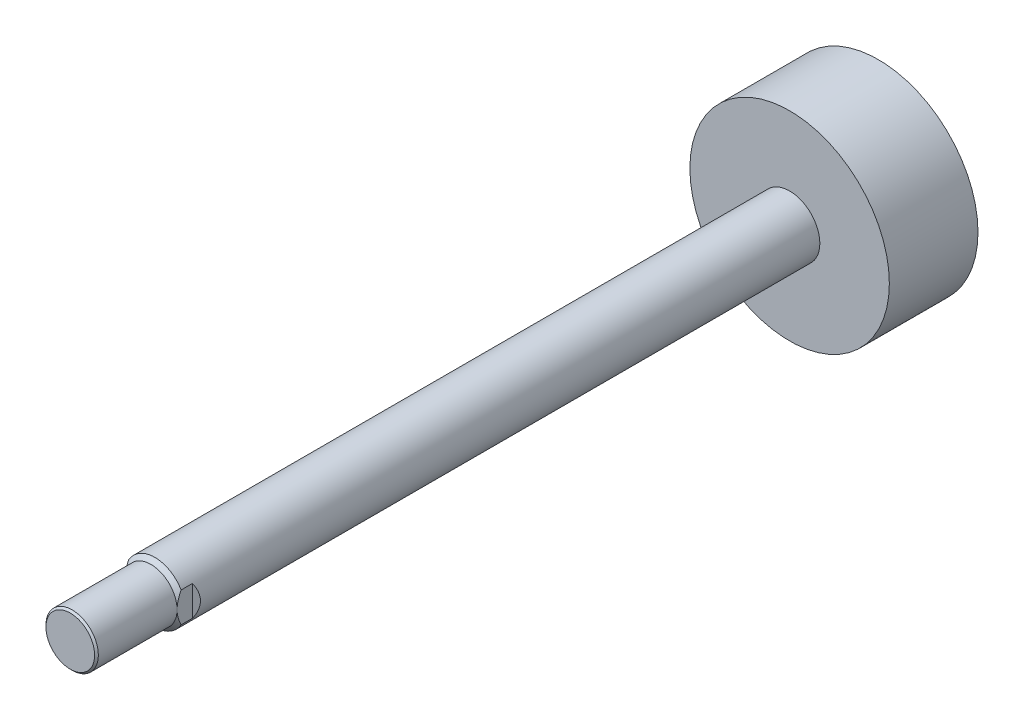
ISO-10303-21;
HEADER;
FILE_DESCRIPTION(('STEP AP214'),'2;1');
FILE_NAME('part.step','',(''),(''),'','','');
FILE_SCHEMA(('AUTOMOTIVE_DESIGN { 1 0 10303 214 1 1 1 1 }'));
ENDSEC;
DATA;
#1=APPLICATION_CONTEXT('core data for automotive mechanical design processes');
#2=APPLICATION_PROTOCOL_DEFINITION('international standard','automotive_design',2000,#1);
#3=PRODUCT_CONTEXT('',#1,'mechanical');
#4=PRODUCT('Part','Part','',(#3));
#5=PRODUCT_RELATED_PRODUCT_CATEGORY('part','',(#4));
#6=PRODUCT_DEFINITION_FORMATION('','',#4);
#7=PRODUCT_DEFINITION_CONTEXT('part definition',#1,'design');
#8=PRODUCT_DEFINITION('design','',#6,#7);
#9=PRODUCT_DEFINITION_SHAPE('','',#8);
#10=(LENGTH_UNIT() NAMED_UNIT(*) SI_UNIT(.MILLI.,.METRE.));
#11=(NAMED_UNIT(*) PLANE_ANGLE_UNIT() SI_UNIT($,.RADIAN.));
#12=(NAMED_UNIT(*) SI_UNIT($,.STERADIAN.) SOLID_ANGLE_UNIT());
#13=UNCERTAINTY_MEASURE_WITH_UNIT(LENGTH_MEASURE(1.E-05),#10,'distance_accuracy_value','');
#14=(GEOMETRIC_REPRESENTATION_CONTEXT(3) GLOBAL_UNCERTAINTY_ASSIGNED_CONTEXT((#13)) GLOBAL_UNIT_ASSIGNED_CONTEXT((#10,
#11,#12)) REPRESENTATION_CONTEXT('',''));
#15=CARTESIAN_POINT('',(0.,0.,0.));
#16=DIRECTION('',(0.,0.,1.));
#17=DIRECTION('',(1.,0.,0.));
#18=AXIS2_PLACEMENT_3D('',#15,#16,#17);
#19=CARTESIAN_POINT('',(0.,0.,10.0000000000001));
#20=DIRECTION('',(0.,0.,-1.));
#21=DIRECTION('',(-1.,0.,0.));
#22=AXIS2_PLACEMENT_3D('',#19,#20,#21);
#23=CONICAL_SURFACE('',#22,15.,0.785398163397461);
#24=CARTESIAN_POINT('',(0.,0.,10.0000000000001));
#25=DIRECTION('',(0.,0.,1.));
#26=DIRECTION('',(1.,0.,0.));
#27=AXIS2_PLACEMENT_3D('',#24,#25,#26);
#28=CIRCLE('',#27,15.);
#29=CARTESIAN_POINT('',(13.,7.48331477354788,10.0000000000001));
#30=VERTEX_POINT('',#29);
#31=CARTESIAN_POINT('',(-13.,7.48331477354788,10.0000000000001));
#32=VERTEX_POINT('',#31);
#33=EDGE_CURVE('E120',#30,#32,#28,.T.);
#34=ORIENTED_EDGE('',*,*,#33,.T.);
#35=CARTESIAN_POINT('',(-13.,-36.44095784037,-13.6903529103002));
#36=CARTESIAN_POINT('',(-13.,-36.0162735049657,-13.2903617459706));
#37=CARTESIAN_POINT('',(-13.,-35.5911981977071,-12.8907858042931));
#38=CARTESIAN_POINT('',(-13.,-34.7401767103147,-12.0925609898602));
#39=CARTESIAN_POINT('',(-13.,-34.3142305286753,-11.69391211871));
#40=CARTESIAN_POINT('',(-13.,-33.0349118853332,-10.4994633484616));
#41=CARTESIAN_POINT('',(-13.,-32.1801017326179,-9.70520127025763));
#42=CARTESIAN_POINT('',(-13.,-30.4634632390766,-8.11969262225469));
#43=CARTESIAN_POINT('',(-13.,-29.6016222700359,-7.32845971744985));
#44=CARTESIAN_POINT('',(-13.,-27.871988564408,-5.75256708411677));
#45=CARTESIAN_POINT('',(-13.,-27.0041960110263,-4.9679071548921));
#46=CARTESIAN_POINT('',(-13.,-25.6510487249394,-3.7563998424639));
#47=CARTESIAN_POINT('',(-13.,-25.1683536384719,-3.32658160243338));
#48=CARTESIAN_POINT('',(-13.,-24.2002542905434,-2.47000833681891));
#49=CARTESIAN_POINT('',(-13.,-23.7148500395842,-2.04325329937554));
#50=CARTESIAN_POINT('',(-13.,-22.7408373069011,-1.19330262631773));
#51=CARTESIAN_POINT('',(-13.,-22.2522284734712,-0.770107393435782));
#52=CARTESIAN_POINT('',(-13.,-21.2713218987959,0.0719867477251748));
#53=CARTESIAN_POINT('',(-13.,-20.7790241715431,0.490885672286422));
#54=CARTESIAN_POINT('',(-13.,-19.7907814474105,1.32292203273235));
#55=CARTESIAN_POINT('',(-13.,-19.2948426764584,1.73606685421813));
#56=CARTESIAN_POINT('',(-13.,-18.2977930237187,2.55609728710099));
#57=CARTESIAN_POINT('',(-13.,-17.7966820474835,2.96298278386));
#58=CARTESIAN_POINT('',(-13.,-16.7883692515955,3.7689484659766));
#59=CARTESIAN_POINT('',(-13.,-16.2811686272203,4.16803014391636));
#60=CARTESIAN_POINT('',(-13.,-15.2593190868725,4.95652043660869));
#61=CARTESIAN_POINT('',(-13.,-14.7446705618227,5.34592955615767));
#62=CARTESIAN_POINT('',(-13.,-13.823144224884,6.02618208273716));
#63=CARTESIAN_POINT('',(-13.,-13.4180826907806,6.31948237038202));
#64=CARTESIAN_POINT('',(-13.,-12.6015554708222,6.89707610970917));
#65=CARTESIAN_POINT('',(-13.,-12.1900896351103,7.18136935015779));
#66=CARTESIAN_POINT('',(-13.,-11.3589954832515,7.73930041941608));
#67=CARTESIAN_POINT('',(-13.,-10.9393550223908,8.01292023807748));
#68=CARTESIAN_POINT('',(-13.,-10.0913222356071,8.54624565264295));
#69=CARTESIAN_POINT('',(-13.,-9.6629302449581,8.80595178020953));
#70=CARTESIAN_POINT('',(-13.,-8.8048971566943,9.30266078868258));
#71=CARTESIAN_POINT('',(-13.,-8.37546717118582,9.54002340749155));
#72=CARTESIAN_POINT('',(-13.,-7.50558132305574,9.99347529724473));
#73=CARTESIAN_POINT('',(-13.,-7.06512318330145,10.2095601284743));
#74=CARTESIAN_POINT('',(-13.,-5.72751982890662,10.8163865420762));
#75=CARTESIAN_POINT('',(-13.,-4.81082452642711,11.1677192243014));
#76=CARTESIAN_POINT('',(-13.,-3.54783395938275,11.5281243825654));
#77=CARTESIAN_POINT('',(-13.,-3.22208570315507,11.6104829179193));
#78=CARTESIAN_POINT('',(-13.,-2.56567935594451,11.7531092091747));
#79=CARTESIAN_POINT('',(-13.,-2.23502093680882,11.8133754816439));
#80=CARTESIAN_POINT('',(-13.,-1.57121991214288,11.909496290171));
#81=CARTESIAN_POINT('',(-13.,-1.23808858984476,11.9454280542976));
#82=CARTESIAN_POINT('',(-13.,-0.570034221047799,11.9917764682808));
#83=CARTESIAN_POINT('',(-13.,-0.235111120817173,12.0021923486206));
#84=CARTESIAN_POINT('',(-13.,0.493817825444919,11.9965869809205));
#85=CARTESIAN_POINT('',(-13.,0.887793983726784,11.9755628147745));
#86=CARTESIAN_POINT('',(-13.,1.67233959764857,11.8986973127531));
#87=CARTESIAN_POINT('',(-13.,2.06290835869698,11.8428490387806));
#88=CARTESIAN_POINT('',(-13.,2.84259006588821,11.6984304171011));
#89=CARTESIAN_POINT('',(-13.,3.23163270916168,11.6094854451656));
#90=CARTESIAN_POINT('',(-13.,4.00189033711246,11.4030386515983));
#91=CARTESIAN_POINT('',(-13.,4.3831065735218,11.2855414357271));
#92=CARTESIAN_POINT('',(-13.,5.18861304220164,11.0085845293945));
#93=CARTESIAN_POINT('',(-13.,5.61167672584231,10.8455856752197));
#94=CARTESIAN_POINT('',(-13.,6.44715880049027,10.4940669063348));
#95=CARTESIAN_POINT('',(-13.,6.85957224294695,10.3055353733623));
#96=CARTESIAN_POINT('',(-13.,7.67564363978527,9.9073449369549));
#97=CARTESIAN_POINT('',(-13.,8.07926896052577,9.69761967058881));
#98=CARTESIAN_POINT('',(-13.,8.87735620051123,9.26164681937318));
#99=CARTESIAN_POINT('',(-13.,9.2718195067228,9.0354017571001));
#100=CARTESIAN_POINT('',(-13.,10.0363254311204,8.57935029585433));
#101=CARTESIAN_POINT('',(-13.,10.4066975615818,8.3500934055512));
#102=CARTESIAN_POINT('',(-13.,11.1410350821367,7.88150743083431));
#103=CARTESIAN_POINT('',(-13.,11.5049999626677,7.64217755041187));
#104=CARTESIAN_POINT('',(-13.,12.2244119403413,7.15718343885012));
#105=CARTESIAN_POINT('',(-13.,12.5799040114605,6.91158567643806));
#106=CARTESIAN_POINT('',(-13.,13.2859497439946,6.41359475991637));
#107=CARTESIAN_POINT('',(-13.,13.6365047886379,6.16120356926212));
#108=CARTESIAN_POINT('',(-13.,13.9849843056068,5.90602749483326));
#109=B_SPLINE_CURVE_WITH_KNOTS('',3,(#35,#36,#37,#38,#39,#40,#41,#42,#43,#44,#45,#46,#47,#48,
#49,#50,#51,#52,#53,#54,#55,#56,#57,#58,#59,#60,#61,#62,#63,#64,#65,#66,#67,#68,#69,#70,#71,#72,
#73,#74,#75,#76,#77,#78,#79,#80,#81,#82,#83,#84,#85,#86,#87,#88,#89,#90,#91,#92,#93,#94,#95,#96,
#97,#98,#99,#100,#101,#102,#103,#104,#105,#106,#107,#108),.UNSPECIFIED.,.F.,.F.,(4,2,2,2,2,2,2,
2,2,2,2,2,2,2,2,2,2,2,2,2,2,2,2,2,2,2,2,2,2,2,2,2,2,2,2,2,4),(0.,1.75018438087813,
3.50037179002691,7.00092144792071,10.5107940990009,14.0205591876124,15.9595291379894,
17.8984915774479,19.8376705049712,21.7768420806373,23.7132392476197,25.6496718371445,
27.5857303627033,29.5216876350513,31.0218887437009,32.5221250091307,34.0247919530723,
35.5274014368966,36.9987731019092,38.4704511281629,41.4021906902973,42.409585611022,
43.4170481630506,44.4212982552684,45.4255786336294,46.6075241991477,47.78970532202,
48.9856961778529,50.1814942364032,51.5405820852472,52.9002904576502,54.2643967293604,
55.6282951356112,56.934859284797,58.2415268785762,59.5376798991111,60.833462241478),.UNSPECIFIED.);
#110=CARTESIAN_POINT('',(-13.,0.,12.));
#111=VERTEX_POINT('',#110);
#112=EDGE_CURVE('E90',#32,#111,#109,.F.);
#113=ORIENTED_EDGE('',*,*,#112,.T.);
#114=CARTESIAN_POINT('',(0.,0.,12.));
#115=DIRECTION('',(0.,0.,1.));
#116=DIRECTION('',(1.,0.,0.));
#117=AXIS2_PLACEMENT_3D('',#114,#115,#116);
#118=CIRCLE('',#117,13.);
#119=CARTESIAN_POINT('',(13.,0.,12.));
#120=VERTEX_POINT('',#119);
#121=EDGE_CURVE('E116',#120,#111,#118,.T.);
#122=ORIENTED_EDGE('',*,*,#121,.F.);
#123=CARTESIAN_POINT('',(13.,-36.44095784037,-13.6903529103002));
#124=CARTESIAN_POINT('',(13.,-36.0162735049657,-13.2903617459706));
#125=CARTESIAN_POINT('',(13.,-35.5911981977071,-12.8907858042931));
#126=CARTESIAN_POINT('',(13.,-34.7401767103147,-12.0925609898602));
#127=CARTESIAN_POINT('',(13.,-34.3142305286753,-11.69391211871));
#128=CARTESIAN_POINT('',(13.,-33.0349118853332,-10.4994633484616));
#129=CARTESIAN_POINT('',(13.,-32.1801017326179,-9.70520127025763));
#130=CARTESIAN_POINT('',(13.,-30.4634632390766,-8.11969262225469));
#131=CARTESIAN_POINT('',(13.,-29.6016222700359,-7.32845971744985));
#132=CARTESIAN_POINT('',(13.,-27.871988564408,-5.75256708411677));
#133=CARTESIAN_POINT('',(13.,-27.0041960110263,-4.9679071548921));
#134=CARTESIAN_POINT('',(13.,-25.6510487249394,-3.7563998424639));
#135=CARTESIAN_POINT('',(13.,-25.1683536384719,-3.32658160243338));
#136=CARTESIAN_POINT('',(13.,-24.2002542905434,-2.47000833681891));
#137=CARTESIAN_POINT('',(13.,-23.7148500395842,-2.04325329937554));
#138=CARTESIAN_POINT('',(13.,-22.7408373069011,-1.19330262631773));
#139=CARTESIAN_POINT('',(13.,-22.2522284734712,-0.770107393435782));
#140=CARTESIAN_POINT('',(13.,-21.2713218987959,0.0719867477251748));
#141=CARTESIAN_POINT('',(13.,-20.7790241715431,0.490885672286422));
#142=CARTESIAN_POINT('',(13.,-19.7907814474105,1.32292203273235));
#143=CARTESIAN_POINT('',(13.,-19.2948426764584,1.73606685421813));
#144=CARTESIAN_POINT('',(13.,-18.2977930237187,2.55609728710099));
#145=CARTESIAN_POINT('',(13.,-17.7966820474835,2.96298278386));
#146=CARTESIAN_POINT('',(13.,-16.7883692515955,3.7689484659766));
#147=CARTESIAN_POINT('',(13.,-16.2811686272203,4.16803014391636));
#148=CARTESIAN_POINT('',(13.,-15.2593190868725,4.95652043660869));
#149=CARTESIAN_POINT('',(13.,-14.7446705618227,5.34592955615767));
#150=CARTESIAN_POINT('',(13.,-13.823144224884,6.02618208273716));
#151=CARTESIAN_POINT('',(13.,-13.4180826907806,6.31948237038202));
#152=CARTESIAN_POINT('',(13.,-12.6015554708222,6.89707610970917));
#153=CARTESIAN_POINT('',(13.,-12.1900896351103,7.18136935015779));
#154=CARTESIAN_POINT('',(13.,-11.3589954832515,7.73930041941608));
#155=CARTESIAN_POINT('',(13.,-10.9393550223908,8.01292023807748));
#156=CARTESIAN_POINT('',(13.,-10.0913222356071,8.54624565264295));
#157=CARTESIAN_POINT('',(13.,-9.6629302449581,8.80595178020953));
#158=CARTESIAN_POINT('',(13.,-8.8048971566943,9.30266078868258));
#159=CARTESIAN_POINT('',(13.,-8.37546717118582,9.54002340749155));
#160=CARTESIAN_POINT('',(13.,-7.50558132305574,9.99347529724473));
#161=CARTESIAN_POINT('',(13.,-7.06512318330145,10.2095601284743));
#162=CARTESIAN_POINT('',(13.,-5.72751982890662,10.8163865420762));
#163=CARTESIAN_POINT('',(13.,-4.81082452642711,11.1677192243014));
#164=CARTESIAN_POINT('',(13.,-3.54783395938275,11.5281243825654));
#165=CARTESIAN_POINT('',(13.,-3.22208570315507,11.6104829179193));
#166=CARTESIAN_POINT('',(13.,-2.56567935594451,11.7531092091747));
#167=CARTESIAN_POINT('',(13.,-2.23502093680882,11.8133754816439));
#168=CARTESIAN_POINT('',(13.,-1.57121991214288,11.909496290171));
#169=CARTESIAN_POINT('',(13.,-1.23808858984476,11.9454280542976));
#170=CARTESIAN_POINT('',(13.,-0.570034221047799,11.9917764682808));
#171=CARTESIAN_POINT('',(13.,-0.235111120817173,12.0021923486206));
#172=CARTESIAN_POINT('',(13.,0.493817825444919,11.9965869809205));
#173=CARTESIAN_POINT('',(13.,0.887793983726784,11.9755628147745));
#174=CARTESIAN_POINT('',(13.,1.67233959764857,11.8986973127531));
#175=CARTESIAN_POINT('',(13.,2.06290835869698,11.8428490387806));
#176=CARTESIAN_POINT('',(13.,2.84259006588821,11.6984304171011));
#177=CARTESIAN_POINT('',(13.,3.23163270916168,11.6094854451656));
#178=CARTESIAN_POINT('',(13.,4.00189033711246,11.4030386515983));
#179=CARTESIAN_POINT('',(13.,4.3831065735218,11.2855414357271));
#180=CARTESIAN_POINT('',(13.,5.18861304220164,11.0085845293945));
#181=CARTESIAN_POINT('',(13.,5.61167672584231,10.8455856752197));
#182=CARTESIAN_POINT('',(13.,6.44715880049027,10.4940669063348));
#183=CARTESIAN_POINT('',(13.,6.85957224294695,10.3055353733623));
#184=CARTESIAN_POINT('',(13.,7.67564363978527,9.9073449369549));
#185=CARTESIAN_POINT('',(13.,8.07926896052577,9.69761967058881));
#186=CARTESIAN_POINT('',(13.,8.87735620051123,9.26164681937318));
#187=CARTESIAN_POINT('',(13.,9.2718195067228,9.0354017571001));
#188=CARTESIAN_POINT('',(13.,10.0363254311204,8.57935029585433));
#189=CARTESIAN_POINT('',(13.,10.4066975615818,8.3500934055512));
#190=CARTESIAN_POINT('',(13.,11.1410350821367,7.88150743083431));
#191=CARTESIAN_POINT('',(13.,11.5049999626677,7.64217755041187));
#192=CARTESIAN_POINT('',(13.,12.2244119403413,7.15718343885012));
#193=CARTESIAN_POINT('',(13.,12.5799040114605,6.91158567643806));
#194=CARTESIAN_POINT('',(13.,13.2859497439946,6.41359475991637));
#195=CARTESIAN_POINT('',(13.,13.6365047886379,6.16120356926212));
#196=CARTESIAN_POINT('',(13.,13.9849843056068,5.90602749483326));
#197=B_SPLINE_CURVE_WITH_KNOTS('',3,(#123,#124,#125,#126,#127,#128,#129,#130,#131,#132,#133,
#134,#135,#136,#137,#138,#139,#140,#141,#142,#143,#144,#145,#146,#147,#148,#149,#150,#151,#152,
#153,#154,#155,#156,#157,#158,#159,#160,#161,#162,#163,#164,#165,#166,#167,#168,#169,#170,#171,
#172,#173,#174,#175,#176,#177,#178,#179,#180,#181,#182,#183,#184,#185,#186,#187,#188,#189,#190,
#191,#192,#193,#194,#195,#196),.UNSPECIFIED.,.F.,.F.,(4,2,2,2,2,2,2,2,2,2,2,2,2,2,2,2,2,2,2,2,2,
2,2,2,2,2,2,2,2,2,2,2,2,2,2,2,4),(0.,1.75018438087813,3.50037179002691,7.00092144792071,
10.5107940990009,14.0205591876124,15.9595291379894,17.8984915774479,19.8376705049712,
21.7768420806373,23.7132392476197,25.6496718371445,27.5857303627033,29.5216876350513,
31.0218887437009,32.5221250091307,34.0247919530723,35.5274014368966,36.9987731019092,
38.4704511281629,41.4021906902973,42.409585611022,43.4170481630506,44.4212982552684,
45.4255786336294,46.6075241991477,47.78970532202,48.9856961778529,50.1814942364032,
51.5405820852472,52.9002904576502,54.2643967293604,55.6282951356112,56.934859284797,
58.2415268785762,59.5376798991111,60.833462241478),.UNSPECIFIED.);
#198=EDGE_CURVE('E133',#120,#30,#197,.T.);
#199=ORIENTED_EDGE('',*,*,#198,.T.);
#200=EDGE_LOOP('',(#34,#113,#122,#199));
#201=FACE_BOUND('',#200,.T.);
#202=ADVANCED_FACE('F39',(#201),#23,.T.);
#203=CARTESIAN_POINT('',(0.,0.,52.));
#204=DIRECTION('',(0.,0.,-1.));
#205=DIRECTION('',(-1.,0.,0.));
#206=AXIS2_PLACEMENT_3D('',#203,#204,#205);
#207=PLANE('',#206);
#208=CARTESIAN_POINT('',(0.,0.,52.));
#209=DIRECTION('',(0.,0.,1.));
#210=DIRECTION('',(1.,0.,0.));
#211=AXIS2_PLACEMENT_3D('',#208,#209,#210);
#212=CIRCLE('',#211,12.08);
#213=CARTESIAN_POINT('',(12.08,0.,52.));
#214=VERTEX_POINT('',#213);
#215=EDGE_CURVE('E110',#214,#214,#212,.T.);
#216=ORIENTED_EDGE('',*,*,#215,.T.);
#217=EDGE_LOOP('',(#216));
#218=FACE_BOUND('',#217,.T.);
#219=ADVANCED_FACE('F41',(#218),#207,.F.);
#220=CARTESIAN_POINT('',(0.,0.,51.08));
#221=DIRECTION('',(0.,0.,-1.));
#222=DIRECTION('',(-1.,0.,0.));
#223=AXIS2_PLACEMENT_3D('',#220,#221,#222);
#224=CONICAL_SURFACE('',#223,13.,0.785398163397461);
#225=ORIENTED_EDGE('',*,*,#215,.F.);
#226=EDGE_LOOP('',(#225));
#227=FACE_BOUND('',#226,.T.);
#228=CARTESIAN_POINT('',(0.,0.,51.08));
#229=DIRECTION('',(0.,0.,1.));
#230=DIRECTION('',(1.,0.,0.));
#231=AXIS2_PLACEMENT_3D('',#228,#229,#230);
#232=CIRCLE('',#231,13.);
#233=CARTESIAN_POINT('',(13.,0.,51.08));
#234=VERTEX_POINT('',#233);
#235=EDGE_CURVE('E113',#234,#234,#232,.T.);
#236=ORIENTED_EDGE('',*,*,#235,.T.);
#237=EDGE_LOOP('',(#236));
#238=FACE_BOUND('',#237,.T.);
#239=ADVANCED_FACE('F178',(#227,#238),#224,.T.);
#240=CARTESIAN_POINT('',(0.,0.,-349.));
#241=DIRECTION('',(0.,0.,1.));
#242=DIRECTION('',(1.,0.,0.));
#243=AXIS2_PLACEMENT_3D('',#240,#241,#242);
#244=CYLINDRICAL_SURFACE('',#243,13.);
#245=ORIENTED_EDGE('',*,*,#235,.F.);
#246=EDGE_LOOP('',(#245));
#247=FACE_BOUND('',#246,.T.);
#248=ORIENTED_EDGE('',*,*,#121,.T.);
#249=EDGE_CURVE('E119',#111,#120,#118,.T.);
#250=ORIENTED_EDGE('',*,*,#249,.T.);
#251=EDGE_LOOP('',(#248,#250));
#252=FACE_BOUND('',#251,.T.);
#253=ADVANCED_FACE('F171',(#247,#252),#244,.T.);
#254=ORIENTED_EDGE('',*,*,#249,.F.);
#255=CARTESIAN_POINT('',(-13.,-7.48331477354788,10.0000000000001));
#256=VERTEX_POINT('',#255);
#257=EDGE_CURVE('E95',#111,#256,#109,.F.);
#258=ORIENTED_EDGE('',*,*,#257,.T.);
#259=CARTESIAN_POINT('',(13.,-7.48331477354788,10.0000000000001));
#260=VERTEX_POINT('',#259);
#261=EDGE_CURVE('E122',#256,#260,#28,.T.);
#262=ORIENTED_EDGE('',*,*,#261,.T.);
#263=EDGE_CURVE('E132',#260,#120,#197,.T.);
#264=ORIENTED_EDGE('',*,*,#263,.T.);
#265=EDGE_LOOP('',(#254,#258,#262,#264));
#266=FACE_BOUND('',#265,.T.);
#267=ADVANCED_FACE('F142',(#266),#23,.T.);
#268=CARTESIAN_POINT('',(0.,0.,-349.));
#269=DIRECTION('',(0.,0.,1.));
#270=DIRECTION('',(1.,0.,0.));
#271=AXIS2_PLACEMENT_3D('',#268,#269,#270);
#272=CYLINDRICAL_SURFACE('',#271,15.);
#273=DIRECTION('',(0.,0.,1.));
#274=VECTOR('',#273,1.);
#275=CARTESIAN_POINT('',(-13.,-7.48331477354788,-349.));
#276=LINE('',#275,#274);
#277=CARTESIAN_POINT('',(-13.,-7.48331477354788,4.39999999999996));
#278=VERTEX_POINT('',#277);
#279=EDGE_CURVE('E11',#256,#278,#276,.F.);
#280=ORIENTED_EDGE('',*,*,#279,.T.);
#281=CARTESIAN_POINT('',(0.,0.,17.4));
#282=DIRECTION('',(0.707106781186547,0.,-0.707106781186548));
#283=DIRECTION('',(0.707106781186548,0.,0.707106781186547));
#284=AXIS2_PLACEMENT_3D('',#281,#282,#283);
#285=ELLIPSE('',#284,21.2132034355964,15.);
#286=CARTESIAN_POINT('',(-13.,7.48331477354788,4.39999999999999));
#287=VERTEX_POINT('',#286);
#288=EDGE_CURVE('E53',#278,#287,#285,.T.);
#289=ORIENTED_EDGE('',*,*,#288,.T.);
#290=DIRECTION('',(0.,0.,1.));
#291=VECTOR('',#290,1.);
#292=CARTESIAN_POINT('',(-13.,7.48331477354788,-349.));
#293=LINE('',#292,#291);
#294=EDGE_CURVE('E47',#287,#32,#293,.T.);
#295=ORIENTED_EDGE('',*,*,#294,.T.);
#296=ORIENTED_EDGE('',*,*,#33,.F.);
#297=DIRECTION('',(0.,0.,1.));
#298=VECTOR('',#297,1.);
#299=CARTESIAN_POINT('',(13.,7.48331477354788,-349.));
#300=LINE('',#299,#298);
#301=CARTESIAN_POINT('',(13.,7.48331477354788,4.39999999999996));
#302=VERTEX_POINT('',#301);
#303=EDGE_CURVE('E107',#30,#302,#300,.F.);
#304=ORIENTED_EDGE('',*,*,#303,.T.);
#305=CARTESIAN_POINT('',(0.,0.,17.3999999999999));
#306=DIRECTION('',(-0.707106781186544,0.,-0.707106781186551));
#307=DIRECTION('',(-0.707106781186551,0.,0.707106781186544));
#308=AXIS2_PLACEMENT_3D('',#305,#306,#307);
#309=ELLIPSE('',#308,21.2132034355963,15.);
#310=CARTESIAN_POINT('',(13.,-7.48331477354788,4.39999999999998));
#311=VERTEX_POINT('',#310);
#312=EDGE_CURVE('E103',#302,#311,#309,.T.);
#313=ORIENTED_EDGE('',*,*,#312,.T.);
#314=DIRECTION('',(0.,0.,1.));
#315=VECTOR('',#314,1.);
#316=CARTESIAN_POINT('',(13.,-7.48331477354788,-349.));
#317=LINE('',#316,#315);
#318=EDGE_CURVE('E100',#311,#260,#317,.T.);
#319=ORIENTED_EDGE('',*,*,#318,.T.);
#320=ORIENTED_EDGE('',*,*,#261,.F.);
#321=EDGE_LOOP('',(#280,#289,#295,#296,#304,#313,#319,#320));
#322=FACE_BOUND('',#321,.T.);
#323=CARTESIAN_POINT('',(0.,0.,-305.));
#324=DIRECTION('',(0.,0.,1.));
#325=DIRECTION('',(1.,0.,0.));
#326=AXIS2_PLACEMENT_3D('',#323,#324,#325);
#327=CIRCLE('',#326,15.);
#328=CARTESIAN_POINT('',(15.,0.,-305.));
#329=VERTEX_POINT('',#328);
#330=EDGE_CURVE('E123',#329,#329,#327,.T.);
#331=ORIENTED_EDGE('',*,*,#330,.T.);
#332=EDGE_LOOP('',(#331));
#333=FACE_BOUND('',#332,.T.);
#334=ADVANCED_FACE('F97',(#322,#333),#272,.T.);
#335=CARTESIAN_POINT('',(0.,15.,-305.));
#336=DIRECTION('',(0.,0.,-1.));
#337=DIRECTION('',(-1.,0.,0.));
#338=AXIS2_PLACEMENT_3D('',#335,#336,#337);
#339=PLANE('',#338);
#340=ORIENTED_EDGE('',*,*,#330,.F.);
#341=EDGE_LOOP('',(#340));
#342=FACE_BOUND('',#341,.T.);
#343=CARTESIAN_POINT('',(0.,0.,-305.));
#344=DIRECTION('',(0.,0.,1.));
#345=DIRECTION('',(1.,0.,0.));
#346=AXIS2_PLACEMENT_3D('',#343,#344,#345);
#347=CIRCLE('',#346,49.5);
#348=CARTESIAN_POINT('',(49.5,0.,-305.));
#349=VERTEX_POINT('',#348);
#350=EDGE_CURVE('E126',#349,#349,#347,.T.);
#351=ORIENTED_EDGE('',*,*,#350,.T.);
#352=EDGE_LOOP('',(#351));
#353=FACE_BOUND('',#352,.T.);
#354=ADVANCED_FACE('F163',(#342,#353),#339,.F.);
#355=CARTESIAN_POINT('',(0.,0.,-349.));
#356=DIRECTION('',(0.,0.,1.));
#357=DIRECTION('',(1.,0.,0.));
#358=AXIS2_PLACEMENT_3D('',#355,#356,#357);
#359=CYLINDRICAL_SURFACE('',#358,49.5);
#360=ORIENTED_EDGE('',*,*,#350,.F.);
#361=EDGE_LOOP('',(#360));
#362=FACE_BOUND('',#361,.T.);
#363=CARTESIAN_POINT('',(0.,0.,-349.));
#364=DIRECTION('',(0.,0.,1.));
#365=DIRECTION('',(1.,0.,0.));
#366=AXIS2_PLACEMENT_3D('',#363,#364,#365);
#367=CIRCLE('',#366,49.5);
#368=CARTESIAN_POINT('',(49.5,0.,-349.));
#369=VERTEX_POINT('',#368);
#370=EDGE_CURVE('E129',#369,#369,#367,.T.);
#371=ORIENTED_EDGE('',*,*,#370,.T.);
#372=EDGE_LOOP('',(#371));
#373=FACE_BOUND('',#372,.T.);
#374=ADVANCED_FACE('F159',(#362,#373),#359,.T.);
#375=CARTESIAN_POINT('',(0.,49.5,-349.));
#376=DIRECTION('',(0.,0.,1.));
#377=DIRECTION('',(1.,0.,0.));
#378=AXIS2_PLACEMENT_3D('',#375,#376,#377);
#379=PLANE('',#378);
#380=ORIENTED_EDGE('',*,*,#370,.F.);
#381=EDGE_LOOP('',(#380));
#382=FACE_BOUND('',#381,.T.);
#383=ADVANCED_FACE('F155',(#382),#379,.F.);
#384=CARTESIAN_POINT('',(15.,-15.,2.4));
#385=DIRECTION('',(-0.707106781186544,0.,-0.707106781186551));
#386=DIRECTION('',(-0.707106781186551,0.,0.707106781186544));
#387=AXIS2_PLACEMENT_3D('',#384,#385,#386);
#388=PLANE('',#387);
#389=DIRECTION('',(0.,1.,0.));
#390=VECTOR('',#389,1.);
#391=CARTESIAN_POINT('',(13.,-15.,4.39999999999998));
#392=LINE('',#391,#390);
#393=EDGE_CURVE('E61',#311,#302,#392,.T.);
#394=ORIENTED_EDGE('',*,*,#393,.F.);
#395=ORIENTED_EDGE('',*,*,#312,.F.);
#396=EDGE_LOOP('',(#394,#395));
#397=FACE_BOUND('',#396,.T.);
#398=ADVANCED_FACE('F151',(#397),#388,.F.);
#399=CARTESIAN_POINT('',(13.,-15.,4.39999999999998));
#400=DIRECTION('',(-1.,0.,0.));
#401=DIRECTION('',(0.,0.,1.));
#402=AXIS2_PLACEMENT_3D('',#399,#400,#401);
#403=PLANE('',#402);
#404=ORIENTED_EDGE('',*,*,#393,.T.);
#405=ORIENTED_EDGE('',*,*,#303,.F.);
#406=ORIENTED_EDGE('',*,*,#198,.F.);
#407=ORIENTED_EDGE('',*,*,#263,.F.);
#408=ORIENTED_EDGE('',*,*,#318,.F.);
#409=EDGE_LOOP('',(#404,#405,#406,#407,#408));
#410=FACE_BOUND('',#409,.T.);
#411=ADVANCED_FACE('F146',(#410),#403,.F.);
#412=CARTESIAN_POINT('',(-13.,-15.,4.39999999999999));
#413=DIRECTION('',(0.707106781186547,0.,-0.707106781186548));
#414=DIRECTION('',(-0.707106781186548,0.,-0.707106781186547));
#415=AXIS2_PLACEMENT_3D('',#412,#413,#414);
#416=PLANE('',#415);
#417=DIRECTION('',(0.,1.,0.));
#418=VECTOR('',#417,1.);
#419=CARTESIAN_POINT('',(-13.,-15.,4.39999999999999));
#420=LINE('',#419,#418);
#421=EDGE_CURVE('E88',#278,#287,#420,.T.);
#422=ORIENTED_EDGE('',*,*,#421,.T.);
#423=ORIENTED_EDGE('',*,*,#288,.F.);
#424=EDGE_LOOP('',(#422,#423));
#425=FACE_BOUND('',#424,.T.);
#426=ADVANCED_FACE('F94',(#425),#416,.F.);
#427=CARTESIAN_POINT('',(-13.,-15.,12.));
#428=DIRECTION('',(1.,0.,0.));
#429=DIRECTION('',(0.,0.,-1.));
#430=AXIS2_PLACEMENT_3D('',#427,#428,#429);
#431=PLANE('',#430);
#432=ORIENTED_EDGE('',*,*,#421,.F.);
#433=ORIENTED_EDGE('',*,*,#279,.F.);
#434=ORIENTED_EDGE('',*,*,#257,.F.);
#435=ORIENTED_EDGE('',*,*,#112,.F.);
#436=ORIENTED_EDGE('',*,*,#294,.F.);
#437=EDGE_LOOP('',(#432,#433,#434,#435,#436));
#438=FACE_BOUND('',#437,.T.);
#439=ADVANCED_FACE('F87',(#438),#431,.F.);
#440=CLOSED_SHELL('',(#202,#219,#239,#253,#267,#334,#354,#374,#383,#398,#411,#426,#439));
#441=MANIFOLD_SOLID_BREP('B2',#440);
#442=ADVANCED_BREP_SHAPE_REPRESENTATION('',(#18,#441),#14);
#443=SHAPE_DEFINITION_REPRESENTATION(#9,#442);
ENDSEC;
END-ISO-10303-21;
